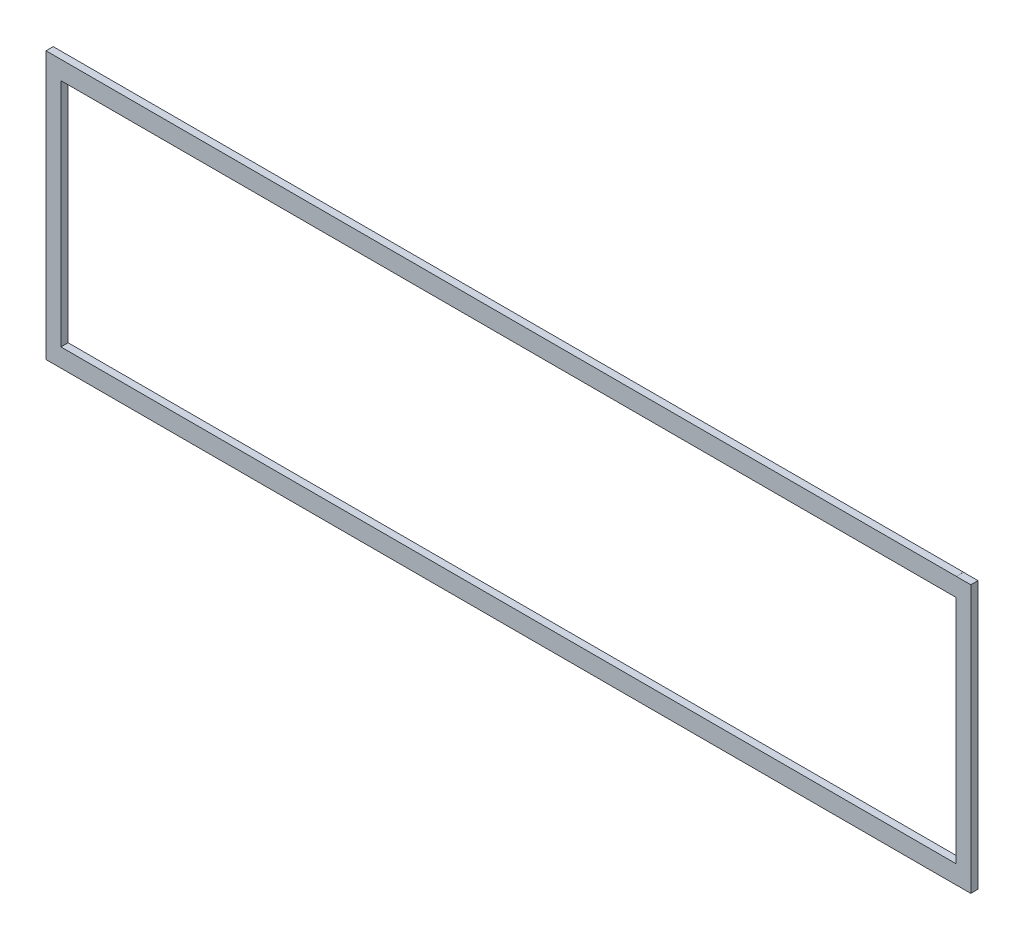
ISO-10303-21;
HEADER;
FILE_DESCRIPTION(('STEP AP214'),'2;1');
FILE_NAME('part.step','',(''),(''),'','','');
FILE_SCHEMA(('AUTOMOTIVE_DESIGN { 1 0 10303 214 1 1 1 1 }'));
ENDSEC;
DATA;
#1=APPLICATION_CONTEXT('core data for automotive mechanical design processes');
#2=APPLICATION_PROTOCOL_DEFINITION('international standard','automotive_design',2000,#1);
#3=PRODUCT_CONTEXT('',#1,'mechanical');
#4=PRODUCT('Part','Part','',(#3));
#5=PRODUCT_RELATED_PRODUCT_CATEGORY('part','',(#4));
#6=PRODUCT_DEFINITION_FORMATION('','',#4);
#7=PRODUCT_DEFINITION_CONTEXT('part definition',#1,'design');
#8=PRODUCT_DEFINITION('design','',#6,#7);
#9=PRODUCT_DEFINITION_SHAPE('','',#8);
#10=(LENGTH_UNIT() NAMED_UNIT(*) SI_UNIT(.MILLI.,.METRE.));
#11=(NAMED_UNIT(*) PLANE_ANGLE_UNIT() SI_UNIT($,.RADIAN.));
#12=(NAMED_UNIT(*) SI_UNIT($,.STERADIAN.) SOLID_ANGLE_UNIT());
#13=UNCERTAINTY_MEASURE_WITH_UNIT(LENGTH_MEASURE(1.E-05),#10,'distance_accuracy_value','');
#14=(GEOMETRIC_REPRESENTATION_CONTEXT(3) GLOBAL_UNCERTAINTY_ASSIGNED_CONTEXT((#13)) GLOBAL_UNIT_ASSIGNED_CONTEXT((#10,
#11,#12)) REPRESENTATION_CONTEXT('',''));
#15=CARTESIAN_POINT('',(0.,0.,0.));
#16=DIRECTION('',(0.,0.,1.));
#17=DIRECTION('',(1.,0.,0.));
#18=AXIS2_PLACEMENT_3D('',#15,#16,#17);
#19=CARTESIAN_POINT('',(6.45160000000001,7.985125,0.));
#20=DIRECTION('',(0.,-1.,0.));
#21=DIRECTION('',(0.,0.,-1.));
#22=AXIS2_PLACEMENT_3D('',#19,#20,#21);
#23=PLANE('',#22);
#24=DIRECTION('',(1.,0.,0.));
#25=VECTOR('',#24,1.);
#26=CARTESIAN_POINT('',(6.45160000000001,7.985125,3.175));
#27=LINE('',#26,#25);
#28=CARTESIAN_POINT('',(6.45160000000001,7.985125,3.175));
#29=VERTEX_POINT('',#28);
#30=CARTESIAN_POINT('',(399.9484,7.985125,3.175));
#31=VERTEX_POINT('',#30);
#32=EDGE_CURVE('E67',#29,#31,#27,.T.);
#33=ORIENTED_EDGE('',*,*,#32,.T.);
#34=DIRECTION('',(0.,0.,1.));
#35=VECTOR('',#34,1.);
#36=CARTESIAN_POINT('',(399.9484,7.985125,0.));
#37=LINE('',#36,#35);
#38=CARTESIAN_POINT('',(399.9484,7.985125,0.));
#39=VERTEX_POINT('',#38);
#40=EDGE_CURVE('E130',#39,#31,#37,.T.);
#41=ORIENTED_EDGE('',*,*,#40,.F.);
#42=DIRECTION('',(1.,0.,0.));
#43=VECTOR('',#42,1.);
#44=CARTESIAN_POINT('',(6.45160000000001,7.985125,0.));
#45=LINE('',#44,#43);
#46=CARTESIAN_POINT('',(6.45160000000001,7.985125,0.));
#47=VERTEX_POINT('',#46);
#48=EDGE_CURVE('E133',#47,#39,#45,.T.);
#49=ORIENTED_EDGE('',*,*,#48,.F.);
#50=DIRECTION('',(0.,0.,1.));
#51=VECTOR('',#50,1.);
#52=CARTESIAN_POINT('',(6.45160000000001,7.985125,0.));
#53=LINE('',#52,#51);
#54=EDGE_CURVE('E169',#47,#29,#53,.T.);
#55=ORIENTED_EDGE('',*,*,#54,.T.);
#56=EDGE_LOOP('',(#33,#41,#49,#55));
#57=FACE_BOUND('',#56,.T.);
#58=ADVANCED_FACE('F41',(#57),#23,.F.);
#59=CARTESIAN_POINT('',(6.45160000000001,109.381925,0.));
#60=DIRECTION('',(-1.,0.,0.));
#61=DIRECTION('',(0.,0.,1.));
#62=AXIS2_PLACEMENT_3D('',#59,#60,#61);
#63=PLANE('',#62);
#64=DIRECTION('',(0.,-1.,0.));
#65=VECTOR('',#64,1.);
#66=CARTESIAN_POINT('',(6.45160000000001,109.381925,3.175));
#67=LINE('',#66,#65);
#68=CARTESIAN_POINT('',(6.45160000000001,109.381925,3.175));
#69=VERTEX_POINT('',#68);
#70=EDGE_CURVE('E150',#69,#29,#67,.T.);
#71=ORIENTED_EDGE('',*,*,#70,.T.);
#72=ORIENTED_EDGE('',*,*,#54,.F.);
#73=DIRECTION('',(0.,-1.,0.));
#74=VECTOR('',#73,1.);
#75=CARTESIAN_POINT('',(6.45160000000001,109.381925,0.));
#76=LINE('',#75,#74);
#77=CARTESIAN_POINT('',(6.45160000000001,109.381925,0.));
#78=VERTEX_POINT('',#77);
#79=EDGE_CURVE('E140',#78,#47,#76,.T.);
#80=ORIENTED_EDGE('',*,*,#79,.F.);
#81=DIRECTION('',(0.,0.,1.));
#82=VECTOR('',#81,1.);
#83=CARTESIAN_POINT('',(6.45160000000001,109.381925,0.));
#84=LINE('',#83,#82);
#85=EDGE_CURVE('E173',#78,#69,#84,.T.);
#86=ORIENTED_EDGE('',*,*,#85,.T.);
#87=EDGE_LOOP('',(#71,#72,#80,#86));
#88=FACE_BOUND('',#87,.T.);
#89=ADVANCED_FACE('F302',(#88),#63,.F.);
#90=CARTESIAN_POINT('',(399.9484,109.381925,0.));
#91=DIRECTION('',(0.,1.,0.));
#92=DIRECTION('',(0.,0.,1.));
#93=AXIS2_PLACEMENT_3D('',#90,#91,#92);
#94=PLANE('',#93);
#95=DIRECTION('',(-1.,0.,0.));
#96=VECTOR('',#95,1.);
#97=CARTESIAN_POINT('',(399.9484,109.381925,3.175));
#98=LINE('',#97,#96);
#99=CARTESIAN_POINT('',(399.9484,109.381925,3.175));
#100=VERTEX_POINT('',#99);
#101=EDGE_CURVE('E154',#100,#69,#98,.T.);
#102=ORIENTED_EDGE('',*,*,#101,.T.);
#103=ORIENTED_EDGE('',*,*,#85,.F.);
#104=DIRECTION('',(-1.,0.,0.));
#105=VECTOR('',#104,1.);
#106=CARTESIAN_POINT('',(399.9484,109.381925,0.));
#107=LINE('',#106,#105);
#108=CARTESIAN_POINT('',(399.9484,109.381925,0.));
#109=VERTEX_POINT('',#108);
#110=EDGE_CURVE('E59',#109,#78,#107,.T.);
#111=ORIENTED_EDGE('',*,*,#110,.F.);
#112=DIRECTION('',(0.,0.,1.));
#113=VECTOR('',#112,1.);
#114=CARTESIAN_POINT('',(399.9484,109.381925,0.));
#115=LINE('',#114,#113);
#116=EDGE_CURVE('E139',#109,#100,#115,.T.);
#117=ORIENTED_EDGE('',*,*,#116,.T.);
#118=EDGE_LOOP('',(#102,#103,#111,#117));
#119=FACE_BOUND('',#118,.T.);
#120=ADVANCED_FACE('F307',(#119),#94,.F.);
#121=CARTESIAN_POINT('',(399.9484,7.985125,0.));
#122=DIRECTION('',(1.,0.,0.));
#123=DIRECTION('',(0.,0.,-1.));
#124=AXIS2_PLACEMENT_3D('',#121,#122,#123);
#125=PLANE('',#124);
#126=DIRECTION('',(0.,1.,0.));
#127=VECTOR('',#126,1.);
#128=CARTESIAN_POINT('',(399.9484,7.985125,3.175));
#129=LINE('',#128,#127);
#130=EDGE_CURVE('E163',#31,#100,#129,.T.);
#131=ORIENTED_EDGE('',*,*,#130,.T.);
#132=ORIENTED_EDGE('',*,*,#116,.F.);
#133=DIRECTION('',(0.,1.,0.));
#134=VECTOR('',#133,1.);
#135=CARTESIAN_POINT('',(399.9484,7.985125,0.));
#136=LINE('',#135,#134);
#137=EDGE_CURVE('E143',#39,#109,#136,.T.);
#138=ORIENTED_EDGE('',*,*,#137,.F.);
#139=ORIENTED_EDGE('',*,*,#40,.T.);
#140=EDGE_LOOP('',(#131,#132,#138,#139));
#141=FACE_BOUND('',#140,.T.);
#142=ADVANCED_FACE('F144',(#141),#125,.F.);
#143=CARTESIAN_POINT('',(0.,0.,3.175));
#144=DIRECTION('',(0.,0.,1.));
#145=DIRECTION('',(1.,0.,0.));
#146=AXIS2_PLACEMENT_3D('',#143,#144,#145);
#147=PLANE('',#146);
#148=DIRECTION('',(0.,1.,0.));
#149=VECTOR('',#148,1.);
#150=CARTESIAN_POINT('',(400.1516,117.44325,3.175));
#151=LINE('',#150,#149);
#152=CARTESIAN_POINT('',(400.1516,117.44325,3.175));
#153=VERTEX_POINT('',#152);
#154=CARTESIAN_POINT('',(400.1516,117.46865,3.175));
#155=VERTEX_POINT('',#154);
#156=EDGE_CURVE('E172',#153,#155,#151,.T.);
#157=ORIENTED_EDGE('',*,*,#156,.T.);
#158=DIRECTION('',(-1.,0.,0.));
#159=VECTOR('',#158,1.);
#160=CARTESIAN_POINT('',(400.1516,117.46865,3.175));
#161=LINE('',#160,#159);
#162=CARTESIAN_POINT('',(-0.1016,117.46865,3.175));
#163=VERTEX_POINT('',#162);
#164=EDGE_CURVE('E214',#155,#163,#161,.T.);
#165=ORIENTED_EDGE('',*,*,#164,.T.);
#166=DIRECTION('',(0.,-1.,0.));
#167=VECTOR('',#166,1.);
#168=CARTESIAN_POINT('',(-0.1016,117.46865,3.175));
#169=LINE('',#168,#167);
#170=CARTESIAN_POINT('',(-0.1016,-0.1016,3.175));
#171=VERTEX_POINT('',#170);
#172=EDGE_CURVE('E218',#163,#171,#169,.T.);
#173=ORIENTED_EDGE('',*,*,#172,.T.);
#174=DIRECTION('',(1.,0.,0.));
#175=VECTOR('',#174,1.);
#176=CARTESIAN_POINT('',(-0.1016,-0.1016,3.175));
#177=LINE('',#176,#175);
#178=CARTESIAN_POINT('',(400.1516,-0.1016,3.175));
#179=VERTEX_POINT('',#178);
#180=EDGE_CURVE('E222',#171,#179,#177,.T.);
#181=ORIENTED_EDGE('',*,*,#180,.T.);
#182=DIRECTION('',(0.,1.,0.));
#183=VECTOR('',#182,1.);
#184=CARTESIAN_POINT('',(400.1516,-0.1016,3.175));
#185=LINE('',#184,#183);
#186=CARTESIAN_POINT('',(400.1516,-0.0762000000000051,3.175));
#187=VERTEX_POINT('',#186);
#188=EDGE_CURVE('E226',#179,#187,#185,.T.);
#189=ORIENTED_EDGE('',*,*,#188,.T.);
#190=DIRECTION('',(1.,0.,0.));
#191=VECTOR('',#190,1.);
#192=CARTESIAN_POINT('',(400.1516,-0.0762000000000051,3.175));
#193=LINE('',#192,#191);
#194=CARTESIAN_POINT('',(406.5016,-0.0762000000000051,3.175));
#195=VERTEX_POINT('',#194);
#196=EDGE_CURVE('E230',#187,#195,#193,.T.);
#197=ORIENTED_EDGE('',*,*,#196,.T.);
#198=DIRECTION('',(0.,1.,0.));
#199=VECTOR('',#198,1.);
#200=CARTESIAN_POINT('',(406.5016,-0.0762000000000051,3.175));
#201=LINE('',#200,#199);
#202=CARTESIAN_POINT('',(406.5016,117.44325,3.175));
#203=VERTEX_POINT('',#202);
#204=EDGE_CURVE('E234',#195,#203,#201,.T.);
#205=ORIENTED_EDGE('',*,*,#204,.T.);
#206=DIRECTION('',(-1.,0.,0.));
#207=VECTOR('',#206,1.);
#208=CARTESIAN_POINT('',(406.5016,117.44325,3.175));
#209=LINE('',#208,#207);
#210=EDGE_CURVE('E183',#203,#153,#209,.T.);
#211=ORIENTED_EDGE('',*,*,#210,.T.);
#212=EDGE_LOOP('',(#157,#165,#173,#181,#189,#197,#205,#211));
#213=FACE_BOUND('',#212,.T.);
#214=ORIENTED_EDGE('',*,*,#32,.F.);
#215=ORIENTED_EDGE('',*,*,#70,.F.);
#216=ORIENTED_EDGE('',*,*,#101,.F.);
#217=ORIENTED_EDGE('',*,*,#130,.F.);
#218=EDGE_LOOP('',(#214,#215,#216,#217));
#219=FACE_BOUND('',#218,.T.);
#220=ADVANCED_FACE('F267',(#213,#219),#147,.T.);
#221=CARTESIAN_POINT('',(0.,0.,0.));
#222=DIRECTION('',(0.,0.,1.));
#223=DIRECTION('',(1.,0.,0.));
#224=AXIS2_PLACEMENT_3D('',#221,#222,#223);
#225=PLANE('',#224);
#226=DIRECTION('',(0.,1.,0.));
#227=VECTOR('',#226,1.);
#228=CARTESIAN_POINT('',(400.1516,117.44325,0.));
#229=LINE('',#228,#227);
#230=CARTESIAN_POINT('',(400.1516,117.44325,0.));
#231=VERTEX_POINT('',#230);
#232=CARTESIAN_POINT('',(400.1516,117.46865,0.));
#233=VERTEX_POINT('',#232);
#234=EDGE_CURVE('E178',#231,#233,#229,.T.);
#235=ORIENTED_EDGE('',*,*,#234,.F.);
#236=DIRECTION('',(-1.,0.,0.));
#237=VECTOR('',#236,1.);
#238=CARTESIAN_POINT('',(406.5016,117.44325,0.));
#239=LINE('',#238,#237);
#240=CARTESIAN_POINT('',(406.5016,117.44325,0.));
#241=VERTEX_POINT('',#240);
#242=EDGE_CURVE('E207',#241,#231,#239,.T.);
#243=ORIENTED_EDGE('',*,*,#242,.F.);
#244=DIRECTION('',(0.,1.,0.));
#245=VECTOR('',#244,1.);
#246=CARTESIAN_POINT('',(406.5016,-0.0762000000000051,0.));
#247=LINE('',#246,#245);
#248=CARTESIAN_POINT('',(406.5016,-0.0762000000000051,0.));
#249=VERTEX_POINT('',#248);
#250=EDGE_CURVE('E203',#249,#241,#247,.T.);
#251=ORIENTED_EDGE('',*,*,#250,.F.);
#252=DIRECTION('',(1.,0.,0.));
#253=VECTOR('',#252,1.);
#254=CARTESIAN_POINT('',(400.1516,-0.0762000000000051,0.));
#255=LINE('',#254,#253);
#256=CARTESIAN_POINT('',(400.1516,-0.0762000000000051,0.));
#257=VERTEX_POINT('',#256);
#258=EDGE_CURVE('E199',#257,#249,#255,.T.);
#259=ORIENTED_EDGE('',*,*,#258,.F.);
#260=DIRECTION('',(0.,1.,0.));
#261=VECTOR('',#260,1.);
#262=CARTESIAN_POINT('',(400.1516,-0.1016,0.));
#263=LINE('',#262,#261);
#264=CARTESIAN_POINT('',(400.1516,-0.1016,0.));
#265=VERTEX_POINT('',#264);
#266=EDGE_CURVE('E195',#265,#257,#263,.T.);
#267=ORIENTED_EDGE('',*,*,#266,.F.);
#268=DIRECTION('',(1.,0.,0.));
#269=VECTOR('',#268,1.);
#270=CARTESIAN_POINT('',(-0.1016,-0.1016,0.));
#271=LINE('',#270,#269);
#272=CARTESIAN_POINT('',(-0.1016,-0.1016,0.));
#273=VERTEX_POINT('',#272);
#274=EDGE_CURVE('E191',#273,#265,#271,.T.);
#275=ORIENTED_EDGE('',*,*,#274,.F.);
#276=DIRECTION('',(0.,-1.,0.));
#277=VECTOR('',#276,1.);
#278=CARTESIAN_POINT('',(-0.1016,117.46865,0.));
#279=LINE('',#278,#277);
#280=CARTESIAN_POINT('',(-0.1016,117.46865,0.));
#281=VERTEX_POINT('',#280);
#282=EDGE_CURVE('E187',#281,#273,#279,.T.);
#283=ORIENTED_EDGE('',*,*,#282,.F.);
#284=DIRECTION('',(-1.,0.,0.));
#285=VECTOR('',#284,1.);
#286=CARTESIAN_POINT('',(400.1516,117.46865,0.));
#287=LINE('',#286,#285);
#288=EDGE_CURVE('E182',#233,#281,#287,.T.);
#289=ORIENTED_EDGE('',*,*,#288,.F.);
#290=EDGE_LOOP('',(#235,#243,#251,#259,#267,#275,#283,#289));
#291=FACE_BOUND('',#290,.T.);
#292=ORIENTED_EDGE('',*,*,#79,.T.);
#293=ORIENTED_EDGE('',*,*,#48,.T.);
#294=ORIENTED_EDGE('',*,*,#137,.T.);
#295=ORIENTED_EDGE('',*,*,#110,.T.);
#296=EDGE_LOOP('',(#292,#293,#294,#295));
#297=FACE_BOUND('',#296,.T.);
#298=ADVANCED_FACE('F43',(#291,#297),#225,.F.);
#299=CARTESIAN_POINT('',(406.5016,117.44325,0.));
#300=DIRECTION('',(0.,1.,0.));
#301=DIRECTION('',(0.,0.,1.));
#302=AXIS2_PLACEMENT_3D('',#299,#300,#301);
#303=PLANE('',#302);
#304=ORIENTED_EDGE('',*,*,#210,.F.);
#305=DIRECTION('',(0.,0.,1.));
#306=VECTOR('',#305,1.);
#307=CARTESIAN_POINT('',(406.5016,117.44325,0.));
#308=LINE('',#307,#306);
#309=EDGE_CURVE('E51',#241,#203,#308,.T.);
#310=ORIENTED_EDGE('',*,*,#309,.F.);
#311=ORIENTED_EDGE('',*,*,#242,.T.);
#312=DIRECTION('',(0.,0.,1.));
#313=VECTOR('',#312,1.);
#314=CARTESIAN_POINT('',(400.1516,117.44325,0.));
#315=LINE('',#314,#313);
#316=EDGE_CURVE('E11',#231,#153,#315,.T.);
#317=ORIENTED_EDGE('',*,*,#316,.T.);
#318=EDGE_LOOP('',(#304,#310,#311,#317));
#319=FACE_BOUND('',#318,.T.);
#320=ADVANCED_FACE('F272',(#319),#303,.T.);
#321=CARTESIAN_POINT('',(406.5016,-0.0762000000000051,0.));
#322=DIRECTION('',(1.,0.,0.));
#323=DIRECTION('',(0.,0.,-1.));
#324=AXIS2_PLACEMENT_3D('',#321,#322,#323);
#325=PLANE('',#324);
#326=ORIENTED_EDGE('',*,*,#204,.F.);
#327=DIRECTION('',(0.,0.,1.));
#328=VECTOR('',#327,1.);
#329=CARTESIAN_POINT('',(406.5016,-0.0762000000000051,0.));
#330=LINE('',#329,#328);
#331=EDGE_CURVE('E243',#249,#195,#330,.T.);
#332=ORIENTED_EDGE('',*,*,#331,.F.);
#333=ORIENTED_EDGE('',*,*,#250,.T.);
#334=ORIENTED_EDGE('',*,*,#309,.T.);
#335=EDGE_LOOP('',(#326,#332,#333,#334));
#336=FACE_BOUND('',#335,.T.);
#337=ADVANCED_FACE('F292',(#336),#325,.T.);
#338=CARTESIAN_POINT('',(400.1516,-0.0762000000000051,0.));
#339=DIRECTION('',(0.,-1.,0.));
#340=DIRECTION('',(0.,0.,-1.));
#341=AXIS2_PLACEMENT_3D('',#338,#339,#340);
#342=PLANE('',#341);
#343=ORIENTED_EDGE('',*,*,#196,.F.);
#344=DIRECTION('',(0.,0.,1.));
#345=VECTOR('',#344,1.);
#346=CARTESIAN_POINT('',(400.1516,-0.0762000000000051,0.));
#347=LINE('',#346,#345);
#348=EDGE_CURVE('E246',#257,#187,#347,.T.);
#349=ORIENTED_EDGE('',*,*,#348,.F.);
#350=ORIENTED_EDGE('',*,*,#258,.T.);
#351=ORIENTED_EDGE('',*,*,#331,.T.);
#352=EDGE_LOOP('',(#343,#349,#350,#351));
#353=FACE_BOUND('',#352,.T.);
#354=ADVANCED_FACE('F290',(#353),#342,.T.);
#355=CARTESIAN_POINT('',(400.1516,-0.1016,0.));
#356=DIRECTION('',(1.,0.,0.));
#357=DIRECTION('',(0.,0.,-1.));
#358=AXIS2_PLACEMENT_3D('',#355,#356,#357);
#359=PLANE('',#358);
#360=ORIENTED_EDGE('',*,*,#188,.F.);
#361=DIRECTION('',(0.,0.,1.));
#362=VECTOR('',#361,1.);
#363=CARTESIAN_POINT('',(400.1516,-0.1016,0.));
#364=LINE('',#363,#362);
#365=EDGE_CURVE('E249',#265,#179,#364,.T.);
#366=ORIENTED_EDGE('',*,*,#365,.F.);
#367=ORIENTED_EDGE('',*,*,#266,.T.);
#368=ORIENTED_EDGE('',*,*,#348,.T.);
#369=EDGE_LOOP('',(#360,#366,#367,#368));
#370=FACE_BOUND('',#369,.T.);
#371=ADVANCED_FACE('F286',(#370),#359,.T.);
#372=CARTESIAN_POINT('',(-0.1016,-0.1016,0.));
#373=DIRECTION('',(0.,-1.,0.));
#374=DIRECTION('',(0.,0.,-1.));
#375=AXIS2_PLACEMENT_3D('',#372,#373,#374);
#376=PLANE('',#375);
#377=ORIENTED_EDGE('',*,*,#180,.F.);
#378=DIRECTION('',(0.,0.,1.));
#379=VECTOR('',#378,1.);
#380=CARTESIAN_POINT('',(-0.1016,-0.1016,0.));
#381=LINE('',#380,#379);
#382=EDGE_CURVE('E252',#273,#171,#381,.T.);
#383=ORIENTED_EDGE('',*,*,#382,.F.);
#384=ORIENTED_EDGE('',*,*,#274,.T.);
#385=ORIENTED_EDGE('',*,*,#365,.T.);
#386=EDGE_LOOP('',(#377,#383,#384,#385));
#387=FACE_BOUND('',#386,.T.);
#388=ADVANCED_FACE('F284',(#387),#376,.T.);
#389=CARTESIAN_POINT('',(-0.1016,117.46865,0.));
#390=DIRECTION('',(-1.,0.,0.));
#391=DIRECTION('',(0.,0.,1.));
#392=AXIS2_PLACEMENT_3D('',#389,#390,#391);
#393=PLANE('',#392);
#394=ORIENTED_EDGE('',*,*,#172,.F.);
#395=DIRECTION('',(0.,0.,1.));
#396=VECTOR('',#395,1.);
#397=CARTESIAN_POINT('',(-0.1016,117.46865,0.));
#398=LINE('',#397,#396);
#399=EDGE_CURVE('E254',#281,#163,#398,.T.);
#400=ORIENTED_EDGE('',*,*,#399,.F.);
#401=ORIENTED_EDGE('',*,*,#282,.T.);
#402=ORIENTED_EDGE('',*,*,#382,.T.);
#403=EDGE_LOOP('',(#394,#400,#401,#402));
#404=FACE_BOUND('',#403,.T.);
#405=ADVANCED_FACE('F280',(#404),#393,.T.);
#406=CARTESIAN_POINT('',(400.1516,117.46865,0.));
#407=DIRECTION('',(0.,1.,0.));
#408=DIRECTION('',(0.,0.,1.));
#409=AXIS2_PLACEMENT_3D('',#406,#407,#408);
#410=PLANE('',#409);
#411=ORIENTED_EDGE('',*,*,#164,.F.);
#412=DIRECTION('',(0.,0.,1.));
#413=VECTOR('',#412,1.);
#414=CARTESIAN_POINT('',(400.1516,117.46865,0.));
#415=LINE('',#414,#413);
#416=EDGE_CURVE('E45',#233,#155,#415,.T.);
#417=ORIENTED_EDGE('',*,*,#416,.F.);
#418=ORIENTED_EDGE('',*,*,#288,.T.);
#419=ORIENTED_EDGE('',*,*,#399,.T.);
#420=EDGE_LOOP('',(#411,#417,#418,#419));
#421=FACE_BOUND('',#420,.T.);
#422=ADVANCED_FACE('F265',(#421),#410,.T.);
#423=CARTESIAN_POINT('',(400.1516,117.44325,0.));
#424=DIRECTION('',(1.,0.,0.));
#425=DIRECTION('',(0.,0.,-1.));
#426=AXIS2_PLACEMENT_3D('',#423,#424,#425);
#427=PLANE('',#426);
#428=ORIENTED_EDGE('',*,*,#156,.F.);
#429=ORIENTED_EDGE('',*,*,#316,.F.);
#430=ORIENTED_EDGE('',*,*,#234,.T.);
#431=ORIENTED_EDGE('',*,*,#416,.T.);
#432=EDGE_LOOP('',(#428,#429,#430,#431));
#433=FACE_BOUND('',#432,.T.);
#434=ADVANCED_FACE('F262',(#433),#427,.T.);
#435=CLOSED_SHELL('',(#58,#89,#120,#142,#220,#298,#320,#337,#354,#371,#388,#405,#422,#434));
#436=MANIFOLD_SOLID_BREP('B2',#435);
#437=ADVANCED_BREP_SHAPE_REPRESENTATION('',(#18,#436),#14);
#438=SHAPE_DEFINITION_REPRESENTATION(#9,#437);
ENDSEC;
END-ISO-10303-21;
